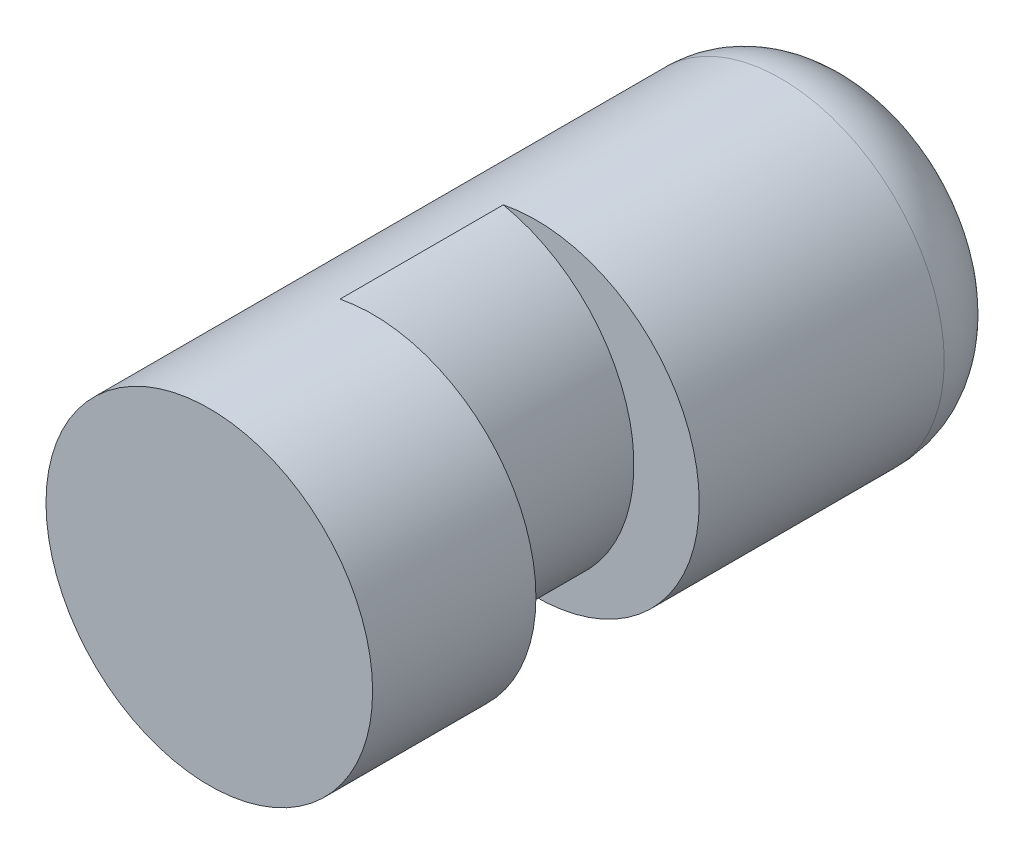
ISO-10303-21;
HEADER;
FILE_DESCRIPTION(('STEP AP214'),'2;1');
FILE_NAME('part.step','',(''),(''),'','','');
FILE_SCHEMA(('AUTOMOTIVE_DESIGN { 1 0 10303 214 1 1 1 1 }'));
ENDSEC;
DATA;
#1=APPLICATION_CONTEXT('core data for automotive mechanical design processes');
#2=APPLICATION_PROTOCOL_DEFINITION('international standard','automotive_design',2000,#1);
#3=PRODUCT_CONTEXT('',#1,'mechanical');
#4=PRODUCT('Part','Part','',(#3));
#5=PRODUCT_RELATED_PRODUCT_CATEGORY('part','',(#4));
#6=PRODUCT_DEFINITION_FORMATION('','',#4);
#7=PRODUCT_DEFINITION_CONTEXT('part definition',#1,'design');
#8=PRODUCT_DEFINITION('design','',#6,#7);
#9=PRODUCT_DEFINITION_SHAPE('','',#8);
#10=(LENGTH_UNIT() NAMED_UNIT(*) SI_UNIT(.MILLI.,.METRE.));
#11=(NAMED_UNIT(*) PLANE_ANGLE_UNIT() SI_UNIT($,.RADIAN.));
#12=(NAMED_UNIT(*) SI_UNIT($,.STERADIAN.) SOLID_ANGLE_UNIT());
#13=UNCERTAINTY_MEASURE_WITH_UNIT(LENGTH_MEASURE(1.E-05),#10,'distance_accuracy_value','');
#14=(GEOMETRIC_REPRESENTATION_CONTEXT(3) GLOBAL_UNCERTAINTY_ASSIGNED_CONTEXT((#13)) GLOBAL_UNIT_ASSIGNED_CONTEXT((#10,
#11,#12)) REPRESENTATION_CONTEXT('',''));
#15=CARTESIAN_POINT('',(0.,0.,0.));
#16=DIRECTION('',(0.,0.,1.));
#17=DIRECTION('',(1.,0.,0.));
#18=AXIS2_PLACEMENT_3D('',#15,#16,#17);
#19=CARTESIAN_POINT('',(-109.908874461109,962.175000000001,-25.4));
#20=DIRECTION('',(0.,0.,1.));
#21=DIRECTION('',(1.,0.,0.));
#22=AXIS2_PLACEMENT_3D('',#19,#20,#21);
#23=CYLINDRICAL_SURFACE('',#22,6.35000000000006);
#24=CARTESIAN_POINT('',(-109.908874461109,962.175000000001,-22.225));
#25=DIRECTION('',(0.,0.,1.));
#26=DIRECTION('',(1.,0.,0.));
#27=AXIS2_PLACEMENT_3D('',#24,#25,#26);
#28=CIRCLE('',#27,6.35000000000006);
#29=CARTESIAN_POINT('',(-103.558874461109,962.175000000001,-22.225));
#30=VERTEX_POINT('',#29);
#31=EDGE_CURVE('E45',#30,#30,#28,.T.);
#32=ORIENTED_EDGE('',*,*,#31,.T.);
#33=EDGE_LOOP('',(#32));
#34=FACE_BOUND('',#33,.T.);
#35=CARTESIAN_POINT('',(-109.908874461109,962.175000000001,-12.7));
#36=DIRECTION('',(0.,0.,-1.));
#37=DIRECTION('',(-1.,0.,0.));
#38=AXIS2_PLACEMENT_3D('',#35,#36,#37);
#39=CIRCLE('',#38,6.35000000000005);
#40=CARTESIAN_POINT('',(-111.178874461109,968.39670394667,-12.7));
#41=VERTEX_POINT('',#40);
#42=CARTESIAN_POINT('',(-111.178874461109,955.953296053332,-12.7));
#43=VERTEX_POINT('',#42);
#44=EDGE_CURVE('E75',#41,#43,#39,.T.);
#45=ORIENTED_EDGE('',*,*,#44,.T.);
#46=DIRECTION('',(0.,0.,1.));
#47=VECTOR('',#46,1.);
#48=CARTESIAN_POINT('',(-111.178874461109,955.953296053332,-12.7));
#49=LINE('',#48,#47);
#50=CARTESIAN_POINT('',(-111.178874461109,955.953296053332,-6.35000000000002));
#51=VERTEX_POINT('',#50);
#52=EDGE_CURVE('E70',#43,#51,#49,.T.);
#53=ORIENTED_EDGE('',*,*,#52,.T.);
#54=CARTESIAN_POINT('',(-109.908874461109,962.175000000001,-6.35000000000002));
#55=DIRECTION('',(0.,0.,-1.));
#56=DIRECTION('',(-1.,0.,0.));
#57=AXIS2_PLACEMENT_3D('',#54,#55,#56);
#58=CIRCLE('',#57,6.35000000000005);
#59=CARTESIAN_POINT('',(-111.178874461109,968.39670394667,-6.35000000000002));
#60=VERTEX_POINT('',#59);
#61=EDGE_CURVE('E76',#60,#51,#58,.T.);
#62=ORIENTED_EDGE('',*,*,#61,.F.);
#63=DIRECTION('',(0.,0.,1.));
#64=VECTOR('',#63,1.);
#65=CARTESIAN_POINT('',(-111.178874461109,968.39670394667,-12.7));
#66=LINE('',#65,#64);
#67=EDGE_CURVE('E54',#41,#60,#66,.T.);
#68=ORIENTED_EDGE('',*,*,#67,.F.);
#69=EDGE_LOOP('',(#45,#53,#62,#68));
#70=FACE_BOUND('',#69,.T.);
#71=CARTESIAN_POINT('',(-109.908874461109,962.175000000001,0.));
#72=DIRECTION('',(0.,0.,1.));
#73=DIRECTION('',(1.,0.,0.));
#74=AXIS2_PLACEMENT_3D('',#71,#72,#73);
#75=CIRCLE('',#74,6.35000000000006);
#76=CARTESIAN_POINT('',(-103.558874461109,962.175000000001,0.));
#77=VERTEX_POINT('',#76);
#78=EDGE_CURVE('E84',#77,#77,#75,.T.);
#79=ORIENTED_EDGE('',*,*,#78,.F.);
#80=EDGE_LOOP('',(#79));
#81=FACE_BOUND('',#80,.T.);
#82=ADVANCED_FACE('F36',(#34,#70,#81),#23,.T.);
#83=CARTESIAN_POINT('',(-109.908874461109,962.175000000001,-25.4));
#84=DIRECTION('',(0.,0.,1.));
#85=DIRECTION('',(1.,0.,0.));
#86=AXIS2_PLACEMENT_3D('',#83,#84,#85);
#87=PLANE('',#86);
#88=CARTESIAN_POINT('',(-109.908874461109,962.175000000001,-25.4));
#89=DIRECTION('',(0.,0.,1.));
#90=DIRECTION('',(1.,0.,0.));
#91=AXIS2_PLACEMENT_3D('',#88,#89,#90);
#92=CIRCLE('',#91,3.17500000000006);
#93=CARTESIAN_POINT('',(-106.733874461109,962.175000000001,-25.4));
#94=VERTEX_POINT('',#93);
#95=EDGE_CURVE('E11',#94,#94,#92,.F.);
#96=ORIENTED_EDGE('',*,*,#95,.T.);
#97=EDGE_LOOP('',(#96));
#98=FACE_BOUND('',#97,.T.);
#99=ADVANCED_FACE('F106',(#98),#87,.F.);
#100=CARTESIAN_POINT('',(-109.908874461109,962.175000000001,0.));
#101=DIRECTION('',(0.,0.,1.));
#102=DIRECTION('',(1.,0.,0.));
#103=AXIS2_PLACEMENT_3D('',#100,#101,#102);
#104=PLANE('',#103);
#105=ORIENTED_EDGE('',*,*,#78,.T.);
#106=EDGE_LOOP('',(#105));
#107=FACE_BOUND('',#106,.T.);
#108=ADVANCED_FACE('F109',(#107),#104,.T.);
#109=CARTESIAN_POINT('',(-112.448874461109,962.175000000001,-12.7));
#110=DIRECTION('',(0.,0.,1.));
#111=DIRECTION('',(1.,0.,0.));
#112=AXIS2_PLACEMENT_3D('',#109,#110,#111);
#113=CYLINDRICAL_SURFACE('',#112,6.35000000000005);
#114=CARTESIAN_POINT('',(-112.448874461109,962.175000000001,-6.35000000000002));
#115=DIRECTION('',(0.,0.,1.));
#116=DIRECTION('',(-1.,0.,0.));
#117=AXIS2_PLACEMENT_3D('',#114,#115,#116);
#118=CIRCLE('',#117,6.35000000000005);
#119=EDGE_CURVE('E66',#51,#60,#118,.T.);
#120=ORIENTED_EDGE('',*,*,#119,.F.);
#121=ORIENTED_EDGE('',*,*,#52,.F.);
#122=CARTESIAN_POINT('',(-112.448874461109,962.175000000001,-12.7));
#123=DIRECTION('',(0.,0.,1.));
#124=DIRECTION('',(-1.,0.,0.));
#125=AXIS2_PLACEMENT_3D('',#122,#123,#124);
#126=CIRCLE('',#125,6.35000000000005);
#127=EDGE_CURVE('E61',#43,#41,#126,.T.);
#128=ORIENTED_EDGE('',*,*,#127,.T.);
#129=ORIENTED_EDGE('',*,*,#67,.T.);
#130=EDGE_LOOP('',(#120,#121,#128,#129));
#131=FACE_BOUND('',#130,.T.);
#132=ADVANCED_FACE('F68',(#131),#113,.T.);
#133=CARTESIAN_POINT('',(-111.178874461109,962.175000000001,-12.7));
#134=DIRECTION('',(0.,0.,-1.));
#135=DIRECTION('',(-1.,0.,0.));
#136=AXIS2_PLACEMENT_3D('',#133,#134,#135);
#137=PLANE('',#136);
#138=ORIENTED_EDGE('',*,*,#44,.F.);
#139=ORIENTED_EDGE('',*,*,#127,.F.);
#140=EDGE_LOOP('',(#138,#139));
#141=FACE_BOUND('',#140,.T.);
#142=ADVANCED_FACE('F102',(#141),#137,.F.);
#143=CARTESIAN_POINT('',(-111.178874461109,962.175000000001,-6.35000000000002));
#144=DIRECTION('',(0.,0.,-1.));
#145=DIRECTION('',(-1.,0.,0.));
#146=AXIS2_PLACEMENT_3D('',#143,#144,#145);
#147=PLANE('',#146);
#148=ORIENTED_EDGE('',*,*,#61,.T.);
#149=ORIENTED_EDGE('',*,*,#119,.T.);
#150=EDGE_LOOP('',(#148,#149));
#151=FACE_BOUND('',#150,.T.);
#152=ADVANCED_FACE('F78',(#151),#147,.T.);
#153=CARTESIAN_POINT('',(-109.908874461109,962.175000000001,-22.225));
#154=DIRECTION('',(0.,0.,1.));
#155=DIRECTION('',(1.,0.,0.));
#156=AXIS2_PLACEMENT_3D('',#153,#154,#155);
#157=TOROIDAL_SURFACE('',#156,3.17500000000006,3.175);
#158=ORIENTED_EDGE('',*,*,#95,.F.);
#159=EDGE_LOOP('',(#158));
#160=FACE_BOUND('',#159,.T.);
#161=ORIENTED_EDGE('',*,*,#31,.F.);
#162=EDGE_LOOP('',(#161));
#163=FACE_BOUND('',#162,.T.);
#164=ADVANCED_FACE('F38',(#160,#163),#157,.T.);
#165=CLOSED_SHELL('',(#82,#99,#108,#132,#142,#152,#164));
#166=MANIFOLD_SOLID_BREP('B2',#165);
#167=ADVANCED_BREP_SHAPE_REPRESENTATION('',(#18,#166),#14);
#168=SHAPE_DEFINITION_REPRESENTATION(#9,#167);
ENDSEC;
END-ISO-10303-21;
